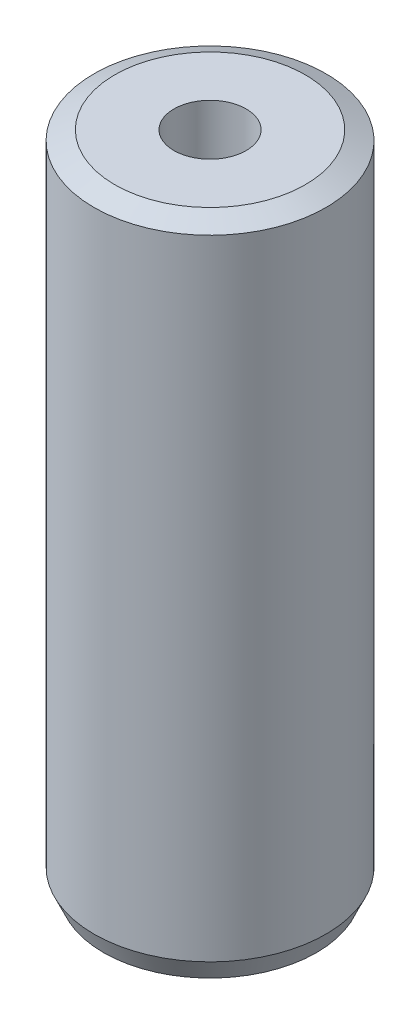
ISO-10303-21;
HEADER;
FILE_DESCRIPTION(('STEP AP214'),'2;1');
FILE_NAME('part.step','',(''),(''),'','','');
FILE_SCHEMA(('AUTOMOTIVE_DESIGN { 1 0 10303 214 1 1 1 1 }'));
ENDSEC;
DATA;
#1=APPLICATION_CONTEXT('core data for automotive mechanical design processes');
#2=APPLICATION_PROTOCOL_DEFINITION('international standard','automotive_design',2000,#1);
#3=PRODUCT_CONTEXT('',#1,'mechanical');
#4=PRODUCT('Part','Part','',(#3));
#5=PRODUCT_RELATED_PRODUCT_CATEGORY('part','',(#4));
#6=PRODUCT_DEFINITION_FORMATION('','',#4);
#7=PRODUCT_DEFINITION_CONTEXT('part definition',#1,'design');
#8=PRODUCT_DEFINITION('design','',#6,#7);
#9=PRODUCT_DEFINITION_SHAPE('','',#8);
#10=(LENGTH_UNIT() NAMED_UNIT(*) SI_UNIT(.MILLI.,.METRE.));
#11=(NAMED_UNIT(*) PLANE_ANGLE_UNIT() SI_UNIT($,.RADIAN.));
#12=(NAMED_UNIT(*) SI_UNIT($,.STERADIAN.) SOLID_ANGLE_UNIT());
#13=UNCERTAINTY_MEASURE_WITH_UNIT(LENGTH_MEASURE(1.E-05),#10,'distance_accuracy_value','');
#14=(GEOMETRIC_REPRESENTATION_CONTEXT(3) GLOBAL_UNCERTAINTY_ASSIGNED_CONTEXT((#13)) GLOBAL_UNIT_ASSIGNED_CONTEXT((#10,
#11,#12)) REPRESENTATION_CONTEXT('',''));
#15=CARTESIAN_POINT('',(0.,0.,0.));
#16=DIRECTION('',(0.,0.,1.));
#17=DIRECTION('',(1.,0.,0.));
#18=AXIS2_PLACEMENT_3D('',#15,#16,#17);
#19=CARTESIAN_POINT('',(0.,270.112423650586,0.));
#20=DIRECTION('',(0.,-1.,0.));
#21=DIRECTION('',(0.,0.,-1.));
#22=AXIS2_PLACEMENT_3D('',#19,#20,#21);
#23=CYLINDRICAL_SURFACE('',#22,47.5);
#24=CARTESIAN_POINT('',(0.,266.258852176893,0.));
#25=DIRECTION('',(0.,1.,0.));
#26=DIRECTION('',(0.,0.,1.));
#27=AXIS2_PLACEMENT_3D('',#24,#25,#26);
#28=CIRCLE('',#27,47.5);
#29=CARTESIAN_POINT('',(0.,266.258852176893,47.5));
#30=VERTEX_POINT('',#29);
#31=EDGE_CURVE('E50',#30,#30,#28,.F.);
#32=ORIENTED_EDGE('',*,*,#31,.T.);
#33=EDGE_LOOP('',(#32));
#34=FACE_BOUND('',#33,.T.);
#35=CARTESIAN_POINT('',(0.,8.47520401058988,0.));
#36=DIRECTION('',(0.,1.,0.));
#37=DIRECTION('',(0.,0.,1.));
#38=AXIS2_PLACEMENT_3D('',#35,#36,#37);
#39=CIRCLE('',#38,47.5);
#40=CARTESIAN_POINT('',(0.,8.47520401058988,47.5));
#41=VERTEX_POINT('',#40);
#42=EDGE_CURVE('E51',#41,#41,#39,.T.);
#43=ORIENTED_EDGE('',*,*,#42,.T.);
#44=EDGE_LOOP('',(#43));
#45=FACE_BOUND('',#44,.T.);
#46=ADVANCED_FACE('F39',(#34,#45),#23,.T.);
#47=CARTESIAN_POINT('',(0.,270.112423650586,0.));
#48=DIRECTION('',(0.,1.,0.));
#49=DIRECTION('',(0.,0.,1.));
#50=AXIS2_PLACEMENT_3D('',#47,#48,#49);
#51=PLANE('',#50);
#52=CARTESIAN_POINT('',(0.,270.112423650586,0.));
#53=DIRECTION('',(0.,1.,0.));
#54=DIRECTION('',(0.,0.,1.));
#55=AXIS2_PLACEMENT_3D('',#52,#53,#54);
#56=CIRCLE('',#55,39.0247959894101);
#57=CARTESIAN_POINT('',(0.,270.112423650586,39.0247959894101));
#58=VERTEX_POINT('',#57);
#59=EDGE_CURVE('E54',#58,#58,#56,.T.);
#60=ORIENTED_EDGE('',*,*,#59,.T.);
#61=EDGE_LOOP('',(#60));
#62=FACE_BOUND('',#61,.T.);
#63=CARTESIAN_POINT('',(0.,270.112423650586,0.));
#64=DIRECTION('',(0.,1.,0.));
#65=DIRECTION('',(0.,0.,1.));
#66=AXIS2_PLACEMENT_3D('',#63,#64,#65);
#67=CIRCLE('',#66,14.7957656357396);
#68=CARTESIAN_POINT('',(0.,270.112423650586,14.7957656357396));
#69=VERTEX_POINT('',#68);
#70=EDGE_CURVE('E58',#69,#69,#67,.T.);
#71=ORIENTED_EDGE('',*,*,#70,.F.);
#72=EDGE_LOOP('',(#71));
#73=FACE_BOUND('',#72,.T.);
#74=ADVANCED_FACE('F69',(#62,#73),#51,.T.);
#75=CARTESIAN_POINT('',(0.,0.,0.));
#76=DIRECTION('',(0.,1.,0.));
#77=DIRECTION('',(0.,0.,1.));
#78=AXIS2_PLACEMENT_3D('',#75,#76,#77);
#79=PLANE('',#78);
#80=CARTESIAN_POINT('',(0.,0.,0.));
#81=DIRECTION('',(0.,1.,0.));
#82=DIRECTION('',(0.,0.,1.));
#83=AXIS2_PLACEMENT_3D('',#80,#81,#82);
#84=CIRCLE('',#83,43.6464285263066);
#85=CARTESIAN_POINT('',(0.,0.,43.6464285263066));
#86=VERTEX_POINT('',#85);
#87=EDGE_CURVE('E10',#86,#86,#84,.F.);
#88=ORIENTED_EDGE('',*,*,#87,.T.);
#89=EDGE_LOOP('',(#88));
#90=FACE_BOUND('',#89,.T.);
#91=CARTESIAN_POINT('',(0.,0.,0.));
#92=DIRECTION('',(0.,1.,0.));
#93=DIRECTION('',(0.,0.,1.));
#94=AXIS2_PLACEMENT_3D('',#91,#92,#93);
#95=CIRCLE('',#94,14.7957656357396);
#96=CARTESIAN_POINT('',(0.,0.,14.7957656357396));
#97=VERTEX_POINT('',#96);
#98=EDGE_CURVE('E63',#97,#97,#95,.T.);
#99=ORIENTED_EDGE('',*,*,#98,.T.);
#100=EDGE_LOOP('',(#99));
#101=FACE_BOUND('',#100,.T.);
#102=ADVANCED_FACE('F75',(#90,#101),#79,.F.);
#103=CARTESIAN_POINT('',(0.,270.112423650586,0.));
#104=DIRECTION('',(0.,-1.,0.));
#105=DIRECTION('',(0.,0.,-1.));
#106=AXIS2_PLACEMENT_3D('',#103,#104,#105);
#107=CYLINDRICAL_SURFACE('',#106,14.7957656357396);
#108=ORIENTED_EDGE('',*,*,#70,.T.);
#109=EDGE_LOOP('',(#108));
#110=FACE_BOUND('',#109,.T.);
#111=ORIENTED_EDGE('',*,*,#98,.F.);
#112=EDGE_LOOP('',(#111));
#113=FACE_BOUND('',#112,.T.);
#114=ADVANCED_FACE('F70',(#110,#113),#107,.F.);
#115=CARTESIAN_POINT('',(0.,270.112423650586,0.));
#116=DIRECTION('',(0.,-1.,0.));
#117=DIRECTION('',(0.,0.,-1.));
#118=AXIS2_PLACEMENT_3D('',#115,#116,#117);
#119=CONICAL_SURFACE('',#118,39.0247959894101,1.14405090713218);
#120=ORIENTED_EDGE('',*,*,#31,.F.);
#121=EDGE_LOOP('',(#120));
#122=FACE_BOUND('',#121,.T.);
#123=ORIENTED_EDGE('',*,*,#59,.F.);
#124=EDGE_LOOP('',(#123));
#125=FACE_BOUND('',#124,.T.);
#126=ADVANCED_FACE('F81',(#122,#125),#119,.T.);
#127=CARTESIAN_POINT('',(0.,8.47520401058988,0.));
#128=DIRECTION('',(0.,1.,0.));
#129=DIRECTION('',(0.,0.,1.));
#130=AXIS2_PLACEMENT_3D('',#127,#128,#129);
#131=CONICAL_SURFACE('',#130,47.5,0.426745419662709);
#132=CARTESIAN_POINT('',(0.,0.,43.6464285263066));
#133=CARTESIAN_POINT('',(0.,0.0882833751103094,43.6865698958243));
#134=CARTESIAN_POINT('',(0.,0.176566750220621,43.7267112653419));
#135=CARTESIAN_POINT('',(0.,0.353133500441243,43.8069940043772));
#136=CARTESIAN_POINT('',(0.,0.441416875551554,43.8471353738948));
#137=CARTESIAN_POINT('',(0.,0.617983625772176,43.9274181129301));
#138=CARTESIAN_POINT('',(0.,0.706267000882487,43.9675594824477));
#139=CARTESIAN_POINT('',(0.,0.882833751103109,44.047842221483));
#140=CARTESIAN_POINT('',(0.,0.971117126213421,44.0879835910007));
#141=CARTESIAN_POINT('',(0.,1.14768387643404,44.1682663300359));
#142=CARTESIAN_POINT('',(0.,1.23596725154435,44.2084076995536));
#143=CARTESIAN_POINT('',(0.,1.41253400176498,44.2886904385889));
#144=CARTESIAN_POINT('',(0.,1.50081737687529,44.3288318081065));
#145=CARTESIAN_POINT('',(0.,1.67738412709591,44.4091145471418));
#146=CARTESIAN_POINT('',(0.,1.76566750220622,44.4492559166594));
#147=CARTESIAN_POINT('',(0.,1.94223425242685,44.5295386556947));
#148=CARTESIAN_POINT('',(0.,2.03051762753716,44.5696800252123));
#149=CARTESIAN_POINT('',(0.,2.20708437775778,44.6499627642476));
#150=CARTESIAN_POINT('',(0.,2.29536775286809,44.6901041337653));
#151=CARTESIAN_POINT('',(0.,2.47193450308871,44.7703868728005));
#152=CARTESIAN_POINT('',(0.,2.56021787819902,44.8105282423182));
#153=CARTESIAN_POINT('',(0.,2.73678462841965,44.8908109813534));
#154=CARTESIAN_POINT('',(0.,2.82506800352996,44.9309523508711));
#155=CARTESIAN_POINT('',(0.,3.00163475375058,45.0112350899064));
#156=CARTESIAN_POINT('',(0.,3.08991812886089,45.051376459424));
#157=CARTESIAN_POINT('',(0.,3.26648487908151,45.1316591984593));
#158=CARTESIAN_POINT('',(0.,3.35476825419183,45.1718005679769));
#159=CARTESIAN_POINT('',(0.,3.53133500441245,45.2520833070122));
#160=CARTESIAN_POINT('',(0.,3.61961837952276,45.2922246765298));
#161=CARTESIAN_POINT('',(0.,3.79618512974338,45.3725074155651));
#162=CARTESIAN_POINT('',(0.,3.88446850485369,45.4126487850828));
#163=CARTESIAN_POINT('',(0.,4.06103525507431,45.492931524118));
#164=CARTESIAN_POINT('',(0.,4.14931863018463,45.5330728936357));
#165=CARTESIAN_POINT('',(0.,4.32588538040525,45.613355632671));
#166=CARTESIAN_POINT('',(0.,4.41416875551556,45.6534970021886));
#167=CARTESIAN_POINT('',(0.,4.59073550573618,45.7337797412239));
#168=CARTESIAN_POINT('',(0.,4.67901888084649,45.7739211107415));
#169=CARTESIAN_POINT('',(0.,4.85558563106711,45.8542038497768));
#170=CARTESIAN_POINT('',(0.,4.94386900617743,45.8943452192944));
#171=CARTESIAN_POINT('',(0.,5.12043575639805,45.9746279583297));
#172=CARTESIAN_POINT('',(0.,5.20871913150836,46.0147693278474));
#173=CARTESIAN_POINT('',(0.,5.38528588172898,46.0950520668826));
#174=CARTESIAN_POINT('',(0.,5.4735692568393,46.1351934364003));
#175=CARTESIAN_POINT('',(0.,5.65013600705992,46.2154761754355));
#176=CARTESIAN_POINT('',(0.,5.73841938217023,46.2556175449532));
#177=CARTESIAN_POINT('',(0.,5.91498613239085,46.3359002839885));
#178=CARTESIAN_POINT('',(0.,6.00326950750116,46.3760416535061));
#179=CARTESIAN_POINT('',(0.,6.17983625772179,46.4563243925414));
#180=CARTESIAN_POINT('',(0.,6.2681196328321,46.496465762059));
#181=CARTESIAN_POINT('',(0.,6.44468638305272,46.5767485010943));
#182=CARTESIAN_POINT('',(0.,6.53296975816303,46.6168898706119));
#183=CARTESIAN_POINT('',(0.,6.70953650838365,46.6971726096472));
#184=CARTESIAN_POINT('',(0.,6.79781988349396,46.7373139791649));
#185=CARTESIAN_POINT('',(0.,6.97438663371458,46.8175967182001));
#186=CARTESIAN_POINT('',(0.,7.0626700088249,46.8577380877178));
#187=CARTESIAN_POINT('',(0.,7.23923675904552,46.9380208267531));
#188=CARTESIAN_POINT('',(0.,7.32752013415583,46.9781621962707));
#189=CARTESIAN_POINT('',(0.,7.50408688437645,47.058444935306));
#190=CARTESIAN_POINT('',(0.,7.59237025948676,47.0985863048236));
#191=CARTESIAN_POINT('',(0.,7.76893700970739,47.1788690438589));
#192=CARTESIAN_POINT('',(0.,7.8572203848177,47.2190104133765));
#193=CARTESIAN_POINT('',(0.,8.03378713503832,47.2992931524118));
#194=CARTESIAN_POINT('',(0.,8.12207051014863,47.3394345219294));
#195=CARTESIAN_POINT('',(0.,8.29863726036925,47.4197172609647));
#196=CARTESIAN_POINT('',(0.,8.38692063547957,47.4598586304824));
#197=CARTESIAN_POINT('',(0.,8.47520401058988,47.5));
#198=B_SPLINE_CURVE_WITH_KNOTS('',3,(#132,#133,#134,#135,#136,#137,#138,#139,#140,#141,#142,
#143,#144,#145,#146,#147,#148,#149,#150,#151,#152,#153,#154,#155,#156,#157,#158,#159,#160,#161,
#162,#163,#164,#165,#166,#167,#168,#169,#170,#171,#172,#173,#174,#175,#176,#177,#178,#179,#180,
#181,#182,#183,#184,#185,#186,#187,#188,#189,#190,#191,#192,#193,#194,#195,#196,#197),
.UNSPECIFIED.,.F.,.F.,(4,2,2,2,2,2,2,2,2,2,2,2,2,2,2,2,2,2,2,2,2,2,2,2,2,2,2,2,2,2,2,2,4),(0.,
0.290942528360115,0.581885056720229,0.872827585080343,1.16377011344046,1.45471264180057,
1.74565517016069,2.0365976985208,2.32754022688092,2.61848275524103,2.90942528360115,
3.20036781196126,3.49131034032138,3.78225286868149,4.07319539704161,4.36413792540172,
4.65508045376184,4.94602298212195,5.23696551048207,5.52790803884218,5.8188505672023,
6.10979309556242,6.40073562392253,6.69167815228265,6.98262068064276,7.27356320900287,
7.56450573736299,7.8554482657231,8.14639079408322,8.43733332244334,8.72827585080345,
9.01921837916357,9.31016090752368),.UNSPECIFIED.);
#199=EDGE_CURVE('BSEAM45',#86,#41,#198,.T.);
#200=ORIENTED_EDGE('',*,*,#87,.F.);
#201=ORIENTED_EDGE('',*,*,#42,.F.);
#202=ORIENTED_EDGE('',*,*,#199,.T.);
#203=ORIENTED_EDGE('',*,*,#199,.F.);
#204=EDGE_LOOP('',(#200,#202,#201,#203));
#205=FACE_BOUND('',#204,.T.);
#206=ADVANCED_FACE('F45',(#205),#131,.T.);
#207=CLOSED_SHELL('',(#46,#74,#102,#114,#126,#206));
#208=MANIFOLD_SOLID_BREP('B2',#207);
#209=ADVANCED_BREP_SHAPE_REPRESENTATION('',(#18,#208),#14);
#210=SHAPE_DEFINITION_REPRESENTATION(#9,#209);
ENDSEC;
END-ISO-10303-21;
